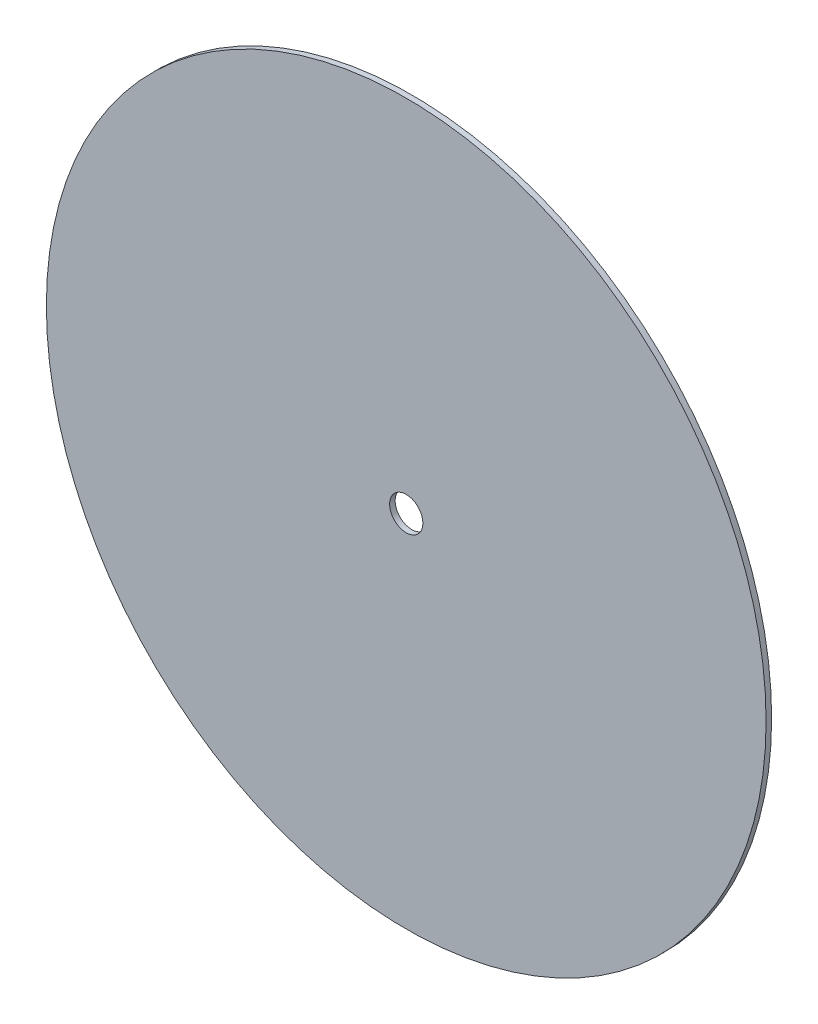
ISO-10303-21;
HEADER;
FILE_DESCRIPTION(('STEP AP214'),'2;1');
FILE_NAME('part.step','',(''),(''),'','','');
FILE_SCHEMA(('AUTOMOTIVE_DESIGN { 1 0 10303 214 1 1 1 1 }'));
ENDSEC;
DATA;
#1=APPLICATION_CONTEXT('core data for automotive mechanical design processes');
#2=APPLICATION_PROTOCOL_DEFINITION('international standard','automotive_design',2000,#1);
#3=PRODUCT_CONTEXT('',#1,'mechanical');
#4=PRODUCT('Part','Part','',(#3));
#5=PRODUCT_RELATED_PRODUCT_CATEGORY('part','',(#4));
#6=PRODUCT_DEFINITION_FORMATION('','',#4);
#7=PRODUCT_DEFINITION_CONTEXT('part definition',#1,'design');
#8=PRODUCT_DEFINITION('design','',#6,#7);
#9=PRODUCT_DEFINITION_SHAPE('','',#8);
#10=(LENGTH_UNIT() NAMED_UNIT(*) SI_UNIT(.MILLI.,.METRE.));
#11=(NAMED_UNIT(*) PLANE_ANGLE_UNIT() SI_UNIT($,.RADIAN.));
#12=(NAMED_UNIT(*) SI_UNIT($,.STERADIAN.) SOLID_ANGLE_UNIT());
#13=UNCERTAINTY_MEASURE_WITH_UNIT(LENGTH_MEASURE(1.E-05),#10,'distance_accuracy_value','');
#14=(GEOMETRIC_REPRESENTATION_CONTEXT(3) GLOBAL_UNCERTAINTY_ASSIGNED_CONTEXT((#13)) GLOBAL_UNIT_ASSIGNED_CONTEXT((#10,
#11,#12)) REPRESENTATION_CONTEXT('',''));
#15=CARTESIAN_POINT('',(0.,0.,0.));
#16=DIRECTION('',(0.,0.,1.));
#17=DIRECTION('',(1.,0.,0.));
#18=AXIS2_PLACEMENT_3D('',#15,#16,#17);
#19=CARTESIAN_POINT('',(0.,0.,4.));
#20=DIRECTION('',(0.,0.,1.));
#21=DIRECTION('',(1.,0.,0.));
#22=AXIS2_PLACEMENT_3D('',#19,#20,#21);
#23=PLANE('',#22);
#24=CARTESIAN_POINT('',(0.,0.,4.));
#25=DIRECTION('',(0.,0.,1.));
#26=DIRECTION('',(1.,0.,0.));
#27=AXIS2_PLACEMENT_3D('',#24,#25,#26);
#28=CIRCLE('',#27,260.);
#29=CARTESIAN_POINT('',(260.,0.,4.));
#30=VERTEX_POINT('',#29);
#31=EDGE_CURVE('E10',#30,#30,#28,.T.);
#32=ORIENTED_EDGE('',*,*,#31,.T.);
#33=EDGE_LOOP('',(#32));
#34=FACE_BOUND('',#33,.T.);
#35=CARTESIAN_POINT('',(0.,0.,4.));
#36=DIRECTION('',(0.,0.,1.));
#37=DIRECTION('',(1.,0.,0.));
#38=AXIS2_PLACEMENT_3D('',#35,#36,#37);
#39=CIRCLE('',#38,12.);
#40=CARTESIAN_POINT('',(12.,0.,4.));
#41=VERTEX_POINT('',#40);
#42=EDGE_CURVE('E44',#41,#41,#39,.T.);
#43=ORIENTED_EDGE('',*,*,#42,.F.);
#44=EDGE_LOOP('',(#43));
#45=FACE_BOUND('',#44,.T.);
#46=ADVANCED_FACE('F33',(#34,#45),#23,.T.);
#47=CARTESIAN_POINT('',(0.,0.,0.));
#48=DIRECTION('',(0.,0.,1.));
#49=DIRECTION('',(1.,0.,0.));
#50=AXIS2_PLACEMENT_3D('',#47,#48,#49);
#51=PLANE('',#50);
#52=CARTESIAN_POINT('',(0.,0.,0.));
#53=DIRECTION('',(0.,0.,1.));
#54=DIRECTION('',(1.,0.,0.));
#55=AXIS2_PLACEMENT_3D('',#52,#53,#54);
#56=CIRCLE('',#55,260.);
#57=CARTESIAN_POINT('',(260.,0.,0.));
#58=VERTEX_POINT('',#57);
#59=EDGE_CURVE('E37',#58,#58,#56,.T.);
#60=ORIENTED_EDGE('',*,*,#59,.F.);
#61=EDGE_LOOP('',(#60));
#62=FACE_BOUND('',#61,.T.);
#63=CARTESIAN_POINT('',(0.,0.,0.));
#64=DIRECTION('',(0.,0.,1.));
#65=DIRECTION('',(1.,0.,0.));
#66=AXIS2_PLACEMENT_3D('',#63,#64,#65);
#67=CIRCLE('',#66,12.);
#68=CARTESIAN_POINT('',(12.,0.,0.));
#69=VERTEX_POINT('',#68);
#70=EDGE_CURVE('E46',#69,#69,#67,.T.);
#71=ORIENTED_EDGE('',*,*,#70,.T.);
#72=EDGE_LOOP('',(#71));
#73=FACE_BOUND('',#72,.T.);
#74=ADVANCED_FACE('F56',(#62,#73),#51,.F.);
#75=CARTESIAN_POINT('',(0.,0.,4.));
#76=DIRECTION('',(0.,0.,-1.));
#77=DIRECTION('',(-1.,0.,0.));
#78=AXIS2_PLACEMENT_3D('',#75,#76,#77);
#79=CYLINDRICAL_SURFACE('',#78,260.);
#80=ORIENTED_EDGE('',*,*,#31,.F.);
#81=EDGE_LOOP('',(#80));
#82=FACE_BOUND('',#81,.T.);
#83=ORIENTED_EDGE('',*,*,#59,.T.);
#84=EDGE_LOOP('',(#83));
#85=FACE_BOUND('',#84,.T.);
#86=ADVANCED_FACE('F35',(#82,#85),#79,.T.);
#87=CARTESIAN_POINT('',(0.,0.,4.));
#88=DIRECTION('',(0.,0.,-1.));
#89=DIRECTION('',(-1.,0.,0.));
#90=AXIS2_PLACEMENT_3D('',#87,#88,#89);
#91=CYLINDRICAL_SURFACE('',#90,12.);
#92=ORIENTED_EDGE('',*,*,#42,.T.);
#93=EDGE_LOOP('',(#92));
#94=FACE_BOUND('',#93,.T.);
#95=ORIENTED_EDGE('',*,*,#70,.F.);
#96=EDGE_LOOP('',(#95));
#97=FACE_BOUND('',#96,.T.);
#98=ADVANCED_FACE('F52',(#94,#97),#91,.F.);
#99=CLOSED_SHELL('',(#46,#74,#86,#98));
#100=MANIFOLD_SOLID_BREP('B2',#99);
#101=ADVANCED_BREP_SHAPE_REPRESENTATION('',(#18,#100),#14);
#102=SHAPE_DEFINITION_REPRESENTATION(#9,#101);
ENDSEC;
END-ISO-10303-21;
